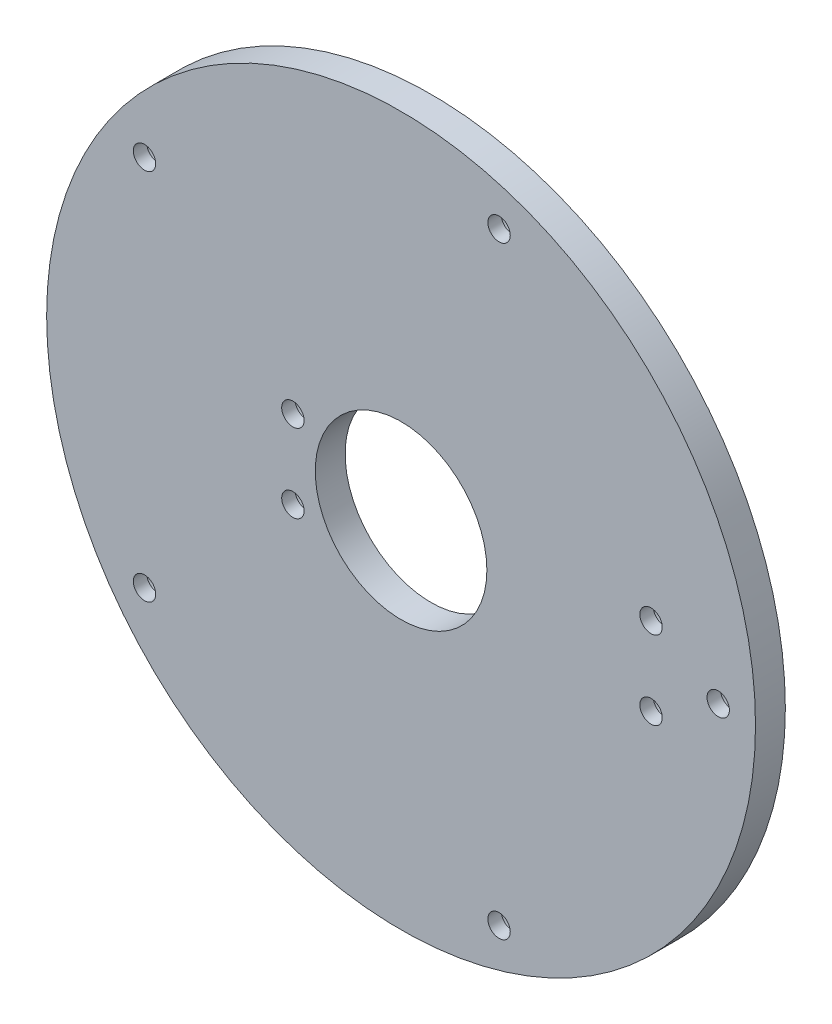
ISO-10303-21;
HEADER;
FILE_DESCRIPTION(('STEP AP214'),'2;1');
FILE_NAME('part.step','',(''),(''),'','','');
FILE_SCHEMA(('AUTOMOTIVE_DESIGN { 1 0 10303 214 1 1 1 1 }'));
ENDSEC;
DATA;
#1=APPLICATION_CONTEXT('core data for automotive mechanical design processes');
#2=APPLICATION_PROTOCOL_DEFINITION('international standard','automotive_design',2000,#1);
#3=PRODUCT_CONTEXT('',#1,'mechanical');
#4=PRODUCT('Part','Part','',(#3));
#5=PRODUCT_RELATED_PRODUCT_CATEGORY('part','',(#4));
#6=PRODUCT_DEFINITION_FORMATION('','',#4);
#7=PRODUCT_DEFINITION_CONTEXT('part definition',#1,'design');
#8=PRODUCT_DEFINITION('design','',#6,#7);
#9=PRODUCT_DEFINITION_SHAPE('','',#8);
#10=(LENGTH_UNIT() NAMED_UNIT(*) SI_UNIT(.MILLI.,.METRE.));
#11=(NAMED_UNIT(*) PLANE_ANGLE_UNIT() SI_UNIT($,.RADIAN.));
#12=(NAMED_UNIT(*) SI_UNIT($,.STERADIAN.) SOLID_ANGLE_UNIT());
#13=UNCERTAINTY_MEASURE_WITH_UNIT(LENGTH_MEASURE(1.E-05),#10,'distance_accuracy_value','');
#14=(GEOMETRIC_REPRESENTATION_CONTEXT(3) GLOBAL_UNCERTAINTY_ASSIGNED_CONTEXT((#13)) GLOBAL_UNIT_ASSIGNED_CONTEXT((#10,
#11,#12)) REPRESENTATION_CONTEXT('',''));
#15=CARTESIAN_POINT('',(0.,0.,0.));
#16=DIRECTION('',(0.,0.,1.));
#17=DIRECTION('',(1.,0.,0.));
#18=AXIS2_PLACEMENT_3D('',#15,#16,#17);
#19=CARTESIAN_POINT('',(47.5,-57.1414213562373,0.));
#20=DIRECTION('',(0.,0.,1.));
#21=DIRECTION('',(1.,0.,0.));
#22=AXIS2_PLACEMENT_3D('',#19,#20,#21);
#23=PLANE('',#22);
#24=CARTESIAN_POINT('',(81.0000000000001,42.125,0.));
#25=DIRECTION('',(0.,0.,1.));
#26=DIRECTION('',(1.,0.,0.));
#27=AXIS2_PLACEMENT_3D('',#24,#25,#26);
#28=CIRCLE('',#27,2.75);
#29=CARTESIAN_POINT('',(83.7500000000001,42.125,0.));
#30=VERTEX_POINT('',#29);
#31=EDGE_CURVE('E182',#30,#30,#28,.T.);
#32=ORIENTED_EDGE('',*,*,#31,.T.);
#33=EDGE_LOOP('',(#32));
#34=FACE_BOUND('',#33,.T.);
#35=CARTESIAN_POINT('',(81.0000000000001,52.625,0.));
#36=DIRECTION('',(0.,0.,1.));
#37=DIRECTION('',(1.,0.,0.));
#38=AXIS2_PLACEMENT_3D('',#35,#36,#37);
#39=CIRCLE('',#38,2.75);
#40=CARTESIAN_POINT('',(83.7500000000001,52.625,0.));
#41=VERTEX_POINT('',#40);
#42=EDGE_CURVE('E193',#41,#41,#39,.T.);
#43=ORIENTED_EDGE('',*,*,#42,.T.);
#44=EDGE_LOOP('',(#43));
#45=FACE_BOUND('',#44,.T.);
#46=CARTESIAN_POINT('',(13.1167777390647,72.4808732224301,0.));
#47=DIRECTION('',(0.,0.,1.));
#48=DIRECTION('',(1.,0.,0.));
#49=AXIS2_PLACEMENT_3D('',#46,#47,#48);
#50=CIRCLE('',#49,2.75);
#51=CARTESIAN_POINT('',(15.8667777390647,72.4808732224301,0.));
#52=VERTEX_POINT('',#51);
#53=EDGE_CURVE('E209',#52,#52,#50,.T.);
#54=ORIENTED_EDGE('',*,*,#53,.T.);
#55=EDGE_LOOP('',(#54));
#56=FACE_BOUND('',#55,.T.);
#57=CARTESIAN_POINT('',(33.,42.125,0.));
#58=DIRECTION('',(0.,0.,1.));
#59=DIRECTION('',(1.,0.,0.));
#60=AXIS2_PLACEMENT_3D('',#57,#58,#59);
#61=CIRCLE('',#60,2.75);
#62=CARTESIAN_POINT('',(35.75,42.125,0.));
#63=VERTEX_POINT('',#62);
#64=EDGE_CURVE('E225',#63,#63,#61,.T.);
#65=ORIENTED_EDGE('',*,*,#64,.T.);
#66=EDGE_LOOP('',(#65));
#67=FACE_BOUND('',#66,.T.);
#68=CARTESIAN_POINT('',(47.5,47.5,0.));
#69=DIRECTION('',(0.,0.,1.));
#70=DIRECTION('',(1.,0.,0.));
#71=AXIS2_PLACEMENT_3D('',#68,#69,#70);
#72=CIRCLE('',#71,47.5);
#73=CARTESIAN_POINT('',(95.,47.5,0.));
#74=VERTEX_POINT('',#73);
#75=EDGE_CURVE('E34',#74,#74,#72,.T.);
#76=ORIENTED_EDGE('',*,*,#75,.F.);
#77=EDGE_LOOP('',(#76));
#78=FACE_BOUND('',#77,.T.);
#79=CARTESIAN_POINT('',(47.5,47.5,0.));
#80=DIRECTION('',(0.,0.,1.));
#81=DIRECTION('',(1.,0.,0.));
#82=AXIS2_PLACEMENT_3D('',#79,#80,#81);
#83=CIRCLE('',#82,11.5);
#84=CARTESIAN_POINT('',(59.,47.5,0.));
#85=VERTEX_POINT('',#84);
#86=EDGE_CURVE('E46',#85,#85,#83,.T.);
#87=ORIENTED_EDGE('',*,*,#86,.T.);
#88=EDGE_LOOP('',(#87));
#89=FACE_BOUND('',#88,.T.);
#90=CARTESIAN_POINT('',(33.,52.625,0.));
#91=DIRECTION('',(0.,0.,1.));
#92=DIRECTION('',(1.,0.,0.));
#93=AXIS2_PLACEMENT_3D('',#90,#91,#92);
#94=CIRCLE('',#93,2.75);
#95=CARTESIAN_POINT('',(35.75,52.625,0.));
#96=VERTEX_POINT('',#95);
#97=EDGE_CURVE('E59',#96,#96,#94,.T.);
#98=ORIENTED_EDGE('',*,*,#97,.T.);
#99=EDGE_LOOP('',(#98));
#100=FACE_BOUND('',#99,.T.);
#101=CARTESIAN_POINT('',(13.1167777390647,22.5191267775699,0.));
#102=DIRECTION('',(0.,0.,1.));
#103=DIRECTION('',(1.,0.,0.));
#104=AXIS2_PLACEMENT_3D('',#101,#102,#103);
#105=CIRCLE('',#104,2.75);
#106=CARTESIAN_POINT('',(15.8667777390647,22.5191267775699,0.));
#107=VERTEX_POINT('',#106);
#108=EDGE_CURVE('E158',#107,#107,#105,.T.);
#109=ORIENTED_EDGE('',*,*,#108,.T.);
#110=EDGE_LOOP('',(#109));
#111=FACE_BOUND('',#110,.T.);
#112=CARTESIAN_POINT('',(60.6332222609353,87.919901942544,0.));
#113=DIRECTION('',(0.,0.,1.));
#114=DIRECTION('',(1.,0.,0.));
#115=AXIS2_PLACEMENT_3D('',#112,#113,#114);
#116=CIRCLE('',#115,2.75);
#117=CARTESIAN_POINT('',(63.3832222609353,87.919901942544,0.));
#118=VERTEX_POINT('',#117);
#119=EDGE_CURVE('E162',#118,#118,#116,.T.);
#120=ORIENTED_EDGE('',*,*,#119,.T.);
#121=EDGE_LOOP('',(#120));
#122=FACE_BOUND('',#121,.T.);
#123=CARTESIAN_POINT('',(90.,47.5,0.));
#124=DIRECTION('',(0.,0.,1.));
#125=DIRECTION('',(1.,0.,0.));
#126=AXIS2_PLACEMENT_3D('',#123,#124,#125);
#127=CIRCLE('',#126,2.75);
#128=CARTESIAN_POINT('',(92.75,47.5,0.));
#129=VERTEX_POINT('',#128);
#130=EDGE_CURVE('E166',#129,#129,#127,.T.);
#131=ORIENTED_EDGE('',*,*,#130,.T.);
#132=EDGE_LOOP('',(#131));
#133=FACE_BOUND('',#132,.T.);
#134=CARTESIAN_POINT('',(60.6332222609353,7.08009805745598,0.));
#135=DIRECTION('',(0.,0.,1.));
#136=DIRECTION('',(1.,0.,0.));
#137=AXIS2_PLACEMENT_3D('',#134,#135,#136);
#138=CIRCLE('',#137,2.75);
#139=CARTESIAN_POINT('',(63.3832222609353,7.08009805745598,0.));
#140=VERTEX_POINT('',#139);
#141=EDGE_CURVE('E169',#140,#140,#138,.T.);
#142=ORIENTED_EDGE('',*,*,#141,.T.);
#143=EDGE_LOOP('',(#142));
#144=FACE_BOUND('',#143,.T.);
#145=ADVANCED_FACE('F30',(#34,#45,#56,#67,#78,#89,#100,#111,#122,#133,#144),#23,.F.);
#146=CARTESIAN_POINT('',(90.,47.5,4.));
#147=DIRECTION('',(0.,0.,-1.));
#148=DIRECTION('',(-1.,0.,0.));
#149=AXIS2_PLACEMENT_3D('',#146,#147,#148);
#150=CYLINDRICAL_SURFACE('',#149,1.5);
#151=CARTESIAN_POINT('',(90.,47.5,2.2));
#152=DIRECTION('',(0.,0.,1.));
#153=DIRECTION('',(1.,0.,0.));
#154=AXIS2_PLACEMENT_3D('',#151,#152,#153);
#155=CIRCLE('',#154,1.5);
#156=CARTESIAN_POINT('',(91.5,47.5,2.2));
#157=VERTEX_POINT('',#156);
#158=EDGE_CURVE('E187',#157,#157,#155,.T.);
#159=ORIENTED_EDGE('',*,*,#158,.F.);
#160=EDGE_LOOP('',(#159));
#161=FACE_BOUND('',#160,.T.);
#162=CARTESIAN_POINT('',(90.,47.5,4.));
#163=DIRECTION('',(0.,0.,1.));
#164=DIRECTION('',(1.,0.,0.));
#165=AXIS2_PLACEMENT_3D('',#162,#163,#164);
#166=CIRCLE('',#165,1.5);
#167=CARTESIAN_POINT('',(91.5,47.5,4.));
#168=VERTEX_POINT('',#167);
#169=EDGE_CURVE('E38',#168,#168,#166,.T.);
#170=ORIENTED_EDGE('',*,*,#169,.T.);
#171=EDGE_LOOP('',(#170));
#172=FACE_BOUND('',#171,.T.);
#173=ADVANCED_FACE('F103',(#161,#172),#150,.F.);
#174=CARTESIAN_POINT('',(81.0000000000001,52.625,4.));
#175=DIRECTION('',(0.,0.,-1.));
#176=DIRECTION('',(-1.,0.,0.));
#177=AXIS2_PLACEMENT_3D('',#174,#175,#176);
#178=CYLINDRICAL_SURFACE('',#177,1.5);
#179=CARTESIAN_POINT('',(81.0000000000001,52.625,2.2));
#180=DIRECTION('',(0.,0.,1.));
#181=DIRECTION('',(1.,0.,0.));
#182=AXIS2_PLACEMENT_3D('',#179,#180,#181);
#183=CIRCLE('',#182,1.5);
#184=CARTESIAN_POINT('',(82.5000000000001,52.625,2.2));
#185=VERTEX_POINT('',#184);
#186=EDGE_CURVE('E195',#185,#185,#183,.T.);
#187=ORIENTED_EDGE('',*,*,#186,.F.);
#188=EDGE_LOOP('',(#187));
#189=FACE_BOUND('',#188,.T.);
#190=CARTESIAN_POINT('',(81.0000000000001,52.625,4.));
#191=DIRECTION('',(0.,0.,1.));
#192=DIRECTION('',(1.,0.,0.));
#193=AXIS2_PLACEMENT_3D('',#190,#191,#192);
#194=CIRCLE('',#193,1.5);
#195=CARTESIAN_POINT('',(82.5000000000001,52.625,4.));
#196=VERTEX_POINT('',#195);
#197=EDGE_CURVE('E43',#196,#196,#194,.T.);
#198=ORIENTED_EDGE('',*,*,#197,.T.);
#199=EDGE_LOOP('',(#198));
#200=FACE_BOUND('',#199,.T.);
#201=ADVANCED_FACE('F91',(#189,#200),#178,.F.);
#202=CARTESIAN_POINT('',(60.6332222609353,87.919901942544,4.));
#203=DIRECTION('',(0.,0.,-1.));
#204=DIRECTION('',(-1.,0.,0.));
#205=AXIS2_PLACEMENT_3D('',#202,#203,#204);
#206=CYLINDRICAL_SURFACE('',#205,1.5);
#207=CARTESIAN_POINT('',(60.6332222609353,87.919901942544,2.2));
#208=DIRECTION('',(0.,0.,1.));
#209=DIRECTION('',(1.,0.,0.));
#210=AXIS2_PLACEMENT_3D('',#207,#208,#209);
#211=CIRCLE('',#210,1.5);
#212=CARTESIAN_POINT('',(62.1332222609353,87.919901942544,2.2));
#213=VERTEX_POINT('',#212);
#214=EDGE_CURVE('E203',#213,#213,#211,.T.);
#215=ORIENTED_EDGE('',*,*,#214,.F.);
#216=EDGE_LOOP('',(#215));
#217=FACE_BOUND('',#216,.T.);
#218=CARTESIAN_POINT('',(60.6332222609353,87.919901942544,4.));
#219=DIRECTION('',(0.,0.,1.));
#220=DIRECTION('',(1.,0.,0.));
#221=AXIS2_PLACEMENT_3D('',#218,#219,#220);
#222=CIRCLE('',#221,1.5);
#223=CARTESIAN_POINT('',(62.1332222609353,87.919901942544,4.));
#224=VERTEX_POINT('',#223);
#225=EDGE_CURVE('E86',#224,#224,#222,.T.);
#226=ORIENTED_EDGE('',*,*,#225,.T.);
#227=EDGE_LOOP('',(#226));
#228=FACE_BOUND('',#227,.T.);
#229=ADVANCED_FACE('F111',(#217,#228),#206,.F.);
#230=CARTESIAN_POINT('',(13.1167777390647,72.4808732224301,4.));
#231=DIRECTION('',(0.,0.,-1.));
#232=DIRECTION('',(-1.,0.,0.));
#233=AXIS2_PLACEMENT_3D('',#230,#231,#232);
#234=CYLINDRICAL_SURFACE('',#233,1.5);
#235=CARTESIAN_POINT('',(13.1167777390647,72.4808732224301,2.2));
#236=DIRECTION('',(0.,0.,1.));
#237=DIRECTION('',(1.,0.,0.));
#238=AXIS2_PLACEMENT_3D('',#235,#236,#237);
#239=CIRCLE('',#238,1.5);
#240=CARTESIAN_POINT('',(14.6167777390647,72.4808732224301,2.2));
#241=VERTEX_POINT('',#240);
#242=EDGE_CURVE('E211',#241,#241,#239,.T.);
#243=ORIENTED_EDGE('',*,*,#242,.F.);
#244=EDGE_LOOP('',(#243));
#245=FACE_BOUND('',#244,.T.);
#246=CARTESIAN_POINT('',(13.1167777390647,72.4808732224301,4.));
#247=DIRECTION('',(0.,0.,1.));
#248=DIRECTION('',(1.,0.,0.));
#249=AXIS2_PLACEMENT_3D('',#246,#247,#248);
#250=CIRCLE('',#249,1.5);
#251=CARTESIAN_POINT('',(14.6167777390647,72.4808732224301,4.));
#252=VERTEX_POINT('',#251);
#253=EDGE_CURVE('E83',#252,#252,#250,.T.);
#254=ORIENTED_EDGE('',*,*,#253,.T.);
#255=EDGE_LOOP('',(#254));
#256=FACE_BOUND('',#255,.T.);
#257=ADVANCED_FACE('F121',(#245,#256),#234,.F.);
#258=CARTESIAN_POINT('',(33.,52.625,4.));
#259=DIRECTION('',(0.,0.,-1.));
#260=DIRECTION('',(-1.,0.,0.));
#261=AXIS2_PLACEMENT_3D('',#258,#259,#260);
#262=CYLINDRICAL_SURFACE('',#261,1.5);
#263=CARTESIAN_POINT('',(33.,52.625,2.2));
#264=DIRECTION('',(0.,0.,1.));
#265=DIRECTION('',(1.,0.,0.));
#266=AXIS2_PLACEMENT_3D('',#263,#264,#265);
#267=CIRCLE('',#266,1.5);
#268=CARTESIAN_POINT('',(34.5,52.625,2.2));
#269=VERTEX_POINT('',#268);
#270=EDGE_CURVE('E54',#269,#269,#267,.T.);
#271=ORIENTED_EDGE('',*,*,#270,.F.);
#272=EDGE_LOOP('',(#271));
#273=FACE_BOUND('',#272,.T.);
#274=CARTESIAN_POINT('',(33.,52.625,4.));
#275=DIRECTION('',(0.,0.,1.));
#276=DIRECTION('',(1.,0.,0.));
#277=AXIS2_PLACEMENT_3D('',#274,#275,#276);
#278=CIRCLE('',#277,1.5);
#279=CARTESIAN_POINT('',(34.5,52.625,4.));
#280=VERTEX_POINT('',#279);
#281=EDGE_CURVE('E80',#280,#280,#278,.T.);
#282=ORIENTED_EDGE('',*,*,#281,.T.);
#283=EDGE_LOOP('',(#282));
#284=FACE_BOUND('',#283,.T.);
#285=ADVANCED_FACE('F125',(#273,#284),#262,.F.);
#286=CARTESIAN_POINT('',(33.,42.125,4.));
#287=DIRECTION('',(0.,0.,-1.));
#288=DIRECTION('',(-1.,0.,0.));
#289=AXIS2_PLACEMENT_3D('',#286,#287,#288);
#290=CYLINDRICAL_SURFACE('',#289,1.5);
#291=CARTESIAN_POINT('',(33.,42.125,2.2));
#292=DIRECTION('',(0.,0.,1.));
#293=DIRECTION('',(1.,0.,0.));
#294=AXIS2_PLACEMENT_3D('',#291,#292,#293);
#295=CIRCLE('',#294,1.5);
#296=CARTESIAN_POINT('',(34.5,42.125,2.2));
#297=VERTEX_POINT('',#296);
#298=EDGE_CURVE('E227',#297,#297,#295,.T.);
#299=ORIENTED_EDGE('',*,*,#298,.F.);
#300=EDGE_LOOP('',(#299));
#301=FACE_BOUND('',#300,.T.);
#302=CARTESIAN_POINT('',(33.,42.125,4.));
#303=DIRECTION('',(0.,0.,1.));
#304=DIRECTION('',(1.,0.,0.));
#305=AXIS2_PLACEMENT_3D('',#302,#303,#304);
#306=CIRCLE('',#305,1.5);
#307=CARTESIAN_POINT('',(34.5,42.125,4.));
#308=VERTEX_POINT('',#307);
#309=EDGE_CURVE('E77',#308,#308,#306,.T.);
#310=ORIENTED_EDGE('',*,*,#309,.T.);
#311=EDGE_LOOP('',(#310));
#312=FACE_BOUND('',#311,.T.);
#313=ADVANCED_FACE('F129',(#301,#312),#290,.F.);
#314=CARTESIAN_POINT('',(60.6332222609353,7.08009805745598,4.));
#315=DIRECTION('',(0.,0.,-1.));
#316=DIRECTION('',(-1.,0.,0.));
#317=AXIS2_PLACEMENT_3D('',#314,#315,#316);
#318=CYLINDRICAL_SURFACE('',#317,1.5);
#319=CARTESIAN_POINT('',(60.6332222609353,7.08009805745598,2.2));
#320=DIRECTION('',(0.,0.,1.));
#321=DIRECTION('',(1.,0.,0.));
#322=AXIS2_PLACEMENT_3D('',#319,#320,#321);
#323=CIRCLE('',#322,1.5);
#324=CARTESIAN_POINT('',(62.1332222609353,7.08009805745598,2.2));
#325=VERTEX_POINT('',#324);
#326=EDGE_CURVE('E171',#325,#325,#323,.T.);
#327=ORIENTED_EDGE('',*,*,#326,.F.);
#328=EDGE_LOOP('',(#327));
#329=FACE_BOUND('',#328,.T.);
#330=CARTESIAN_POINT('',(60.6332222609353,7.08009805745598,4.));
#331=DIRECTION('',(0.,0.,1.));
#332=DIRECTION('',(1.,0.,0.));
#333=AXIS2_PLACEMENT_3D('',#330,#331,#332);
#334=CIRCLE('',#333,1.5);
#335=CARTESIAN_POINT('',(62.1332222609353,7.08009805745598,4.));
#336=VERTEX_POINT('',#335);
#337=EDGE_CURVE('E74',#336,#336,#334,.T.);
#338=ORIENTED_EDGE('',*,*,#337,.T.);
#339=EDGE_LOOP('',(#338));
#340=FACE_BOUND('',#339,.T.);
#341=ADVANCED_FACE('F133',(#329,#340),#318,.F.);
#342=CARTESIAN_POINT('',(13.1167777390647,22.5191267775699,4.));
#343=DIRECTION('',(0.,0.,-1.));
#344=DIRECTION('',(-1.,0.,0.));
#345=AXIS2_PLACEMENT_3D('',#342,#343,#344);
#346=CYLINDRICAL_SURFACE('',#345,1.5);
#347=CARTESIAN_POINT('',(13.1167777390647,22.5191267775699,2.2));
#348=DIRECTION('',(0.,0.,1.));
#349=DIRECTION('',(1.,0.,0.));
#350=AXIS2_PLACEMENT_3D('',#347,#348,#349);
#351=CIRCLE('',#350,1.5);
#352=CARTESIAN_POINT('',(14.6167777390647,22.5191267775699,2.2));
#353=VERTEX_POINT('',#352);
#354=EDGE_CURVE('E219',#353,#353,#351,.T.);
#355=ORIENTED_EDGE('',*,*,#354,.F.);
#356=EDGE_LOOP('',(#355));
#357=FACE_BOUND('',#356,.T.);
#358=CARTESIAN_POINT('',(13.1167777390647,22.5191267775699,4.));
#359=DIRECTION('',(0.,0.,1.));
#360=DIRECTION('',(1.,0.,0.));
#361=AXIS2_PLACEMENT_3D('',#358,#359,#360);
#362=CIRCLE('',#361,1.5);
#363=CARTESIAN_POINT('',(14.6167777390647,22.5191267775699,4.));
#364=VERTEX_POINT('',#363);
#365=EDGE_CURVE('E71',#364,#364,#362,.T.);
#366=ORIENTED_EDGE('',*,*,#365,.T.);
#367=EDGE_LOOP('',(#366));
#368=FACE_BOUND('',#367,.T.);
#369=ADVANCED_FACE('F137',(#357,#368),#346,.F.);
#370=CARTESIAN_POINT('',(47.5,47.5,4.));
#371=DIRECTION('',(0.,0.,-1.));
#372=DIRECTION('',(-1.,0.,0.));
#373=AXIS2_PLACEMENT_3D('',#370,#371,#372);
#374=CYLINDRICAL_SURFACE('',#373,47.5);
#375=CARTESIAN_POINT('',(47.5,47.5,4.));
#376=DIRECTION('',(0.,0.,1.));
#377=DIRECTION('',(1.,0.,0.));
#378=AXIS2_PLACEMENT_3D('',#375,#376,#377);
#379=CIRCLE('',#378,47.5);
#380=CARTESIAN_POINT('',(95.,47.5,4.));
#381=VERTEX_POINT('',#380);
#382=EDGE_CURVE('E68',#381,#381,#379,.T.);
#383=ORIENTED_EDGE('',*,*,#382,.F.);
#384=EDGE_LOOP('',(#383));
#385=FACE_BOUND('',#384,.T.);
#386=ORIENTED_EDGE('',*,*,#75,.T.);
#387=EDGE_LOOP('',(#386));
#388=FACE_BOUND('',#387,.T.);
#389=ADVANCED_FACE('F140',(#385,#388),#374,.T.);
#390=CARTESIAN_POINT('',(47.5,47.5,4.));
#391=DIRECTION('',(0.,0.,-1.));
#392=DIRECTION('',(-1.,0.,0.));
#393=AXIS2_PLACEMENT_3D('',#390,#391,#392);
#394=CYLINDRICAL_SURFACE('',#393,11.5);
#395=CARTESIAN_POINT('',(47.5,47.5,4.));
#396=DIRECTION('',(0.,0.,1.));
#397=DIRECTION('',(1.,0.,0.));
#398=AXIS2_PLACEMENT_3D('',#395,#396,#397);
#399=CIRCLE('',#398,11.5);
#400=CARTESIAN_POINT('',(59.,47.5,4.));
#401=VERTEX_POINT('',#400);
#402=EDGE_CURVE('E52',#401,#401,#399,.T.);
#403=ORIENTED_EDGE('',*,*,#402,.T.);
#404=EDGE_LOOP('',(#403));
#405=FACE_BOUND('',#404,.T.);
#406=ORIENTED_EDGE('',*,*,#86,.F.);
#407=EDGE_LOOP('',(#406));
#408=FACE_BOUND('',#407,.T.);
#409=ADVANCED_FACE('F32',(#405,#408),#394,.F.);
#410=CARTESIAN_POINT('',(81.0000000000001,42.125,4.));
#411=DIRECTION('',(0.,0.,-1.));
#412=DIRECTION('',(-1.,0.,0.));
#413=AXIS2_PLACEMENT_3D('',#410,#411,#412);
#414=CYLINDRICAL_SURFACE('',#413,1.5);
#415=CARTESIAN_POINT('',(81.0000000000001,42.125,2.2));
#416=DIRECTION('',(0.,0.,1.));
#417=DIRECTION('',(1.,0.,0.));
#418=AXIS2_PLACEMENT_3D('',#415,#416,#417);
#419=CIRCLE('',#418,1.5);
#420=CARTESIAN_POINT('',(82.5000000000001,42.125,2.2));
#421=VERTEX_POINT('',#420);
#422=EDGE_CURVE('E178',#421,#421,#419,.T.);
#423=ORIENTED_EDGE('',*,*,#422,.F.);
#424=EDGE_LOOP('',(#423));
#425=FACE_BOUND('',#424,.T.);
#426=CARTESIAN_POINT('',(81.0000000000001,42.125,4.));
#427=DIRECTION('',(0.,0.,1.));
#428=DIRECTION('',(1.,0.,0.));
#429=AXIS2_PLACEMENT_3D('',#426,#427,#428);
#430=CIRCLE('',#429,1.5);
#431=CARTESIAN_POINT('',(82.5000000000001,42.125,4.));
#432=VERTEX_POINT('',#431);
#433=EDGE_CURVE('E10',#432,#432,#430,.T.);
#434=ORIENTED_EDGE('',*,*,#433,.T.);
#435=EDGE_LOOP('',(#434));
#436=FACE_BOUND('',#435,.T.);
#437=ADVANCED_FACE('F97',(#425,#436),#414,.F.);
#438=CARTESIAN_POINT('',(47.5,-57.1414213562373,4.));
#439=DIRECTION('',(0.,0.,1.));
#440=DIRECTION('',(1.,0.,0.));
#441=AXIS2_PLACEMENT_3D('',#438,#439,#440);
#442=PLANE('',#441);
#443=ORIENTED_EDGE('',*,*,#402,.F.);
#444=EDGE_LOOP('',(#443));
#445=FACE_BOUND('',#444,.T.);
#446=ORIENTED_EDGE('',*,*,#382,.T.);
#447=EDGE_LOOP('',(#446));
#448=FACE_BOUND('',#447,.T.);
#449=ORIENTED_EDGE('',*,*,#365,.F.);
#450=EDGE_LOOP('',(#449));
#451=FACE_BOUND('',#450,.T.);
#452=ORIENTED_EDGE('',*,*,#337,.F.);
#453=EDGE_LOOP('',(#452));
#454=FACE_BOUND('',#453,.T.);
#455=ORIENTED_EDGE('',*,*,#309,.F.);
#456=EDGE_LOOP('',(#455));
#457=FACE_BOUND('',#456,.T.);
#458=ORIENTED_EDGE('',*,*,#281,.F.);
#459=EDGE_LOOP('',(#458));
#460=FACE_BOUND('',#459,.T.);
#461=ORIENTED_EDGE('',*,*,#253,.F.);
#462=EDGE_LOOP('',(#461));
#463=FACE_BOUND('',#462,.T.);
#464=ORIENTED_EDGE('',*,*,#225,.F.);
#465=EDGE_LOOP('',(#464));
#466=FACE_BOUND('',#465,.T.);
#467=ORIENTED_EDGE('',*,*,#197,.F.);
#468=EDGE_LOOP('',(#467));
#469=FACE_BOUND('',#468,.T.);
#470=ORIENTED_EDGE('',*,*,#169,.F.);
#471=EDGE_LOOP('',(#470));
#472=FACE_BOUND('',#471,.T.);
#473=ORIENTED_EDGE('',*,*,#433,.F.);
#474=EDGE_LOOP('',(#473));
#475=FACE_BOUND('',#474,.T.);
#476=ADVANCED_FACE('F93',(#445,#448,#451,#454,#457,#460,#463,#466,#469,#472,#475),#442,.T.);
#477=CARTESIAN_POINT('',(33.,52.625,2.2));
#478=DIRECTION('',(0.,0.,-1.));
#479=DIRECTION('',(-1.,0.,0.));
#480=AXIS2_PLACEMENT_3D('',#477,#478,#479);
#481=CYLINDRICAL_SURFACE('',#480,2.75);
#482=CARTESIAN_POINT('',(33.,52.625,2.2));
#483=DIRECTION('',(0.,0.,1.));
#484=DIRECTION('',(1.,0.,0.));
#485=AXIS2_PLACEMENT_3D('',#482,#483,#484);
#486=CIRCLE('',#485,2.75);
#487=CARTESIAN_POINT('',(35.75,52.625,2.2));
#488=VERTEX_POINT('',#487);
#489=EDGE_CURVE('E48',#488,#488,#486,.T.);
#490=ORIENTED_EDGE('',*,*,#489,.T.);
#491=EDGE_LOOP('',(#490));
#492=FACE_BOUND('',#491,.T.);
#493=ORIENTED_EDGE('',*,*,#97,.F.);
#494=EDGE_LOOP('',(#493));
#495=FACE_BOUND('',#494,.T.);
#496=ADVANCED_FACE('F96',(#492,#495),#481,.F.);
#497=CARTESIAN_POINT('',(47.5,-57.1414213562373,2.2));
#498=DIRECTION('',(0.,0.,1.));
#499=DIRECTION('',(1.,0.,0.));
#500=AXIS2_PLACEMENT_3D('',#497,#498,#499);
#501=PLANE('',#500);
#502=ORIENTED_EDGE('',*,*,#270,.T.);
#503=EDGE_LOOP('',(#502));
#504=FACE_BOUND('',#503,.T.);
#505=ORIENTED_EDGE('',*,*,#489,.F.);
#506=EDGE_LOOP('',(#505));
#507=FACE_BOUND('',#506,.T.);
#508=ADVANCED_FACE('F238',(#504,#507),#501,.F.);
#509=CARTESIAN_POINT('',(33.,42.125,2.2));
#510=DIRECTION('',(0.,0.,-1.));
#511=DIRECTION('',(-1.,0.,0.));
#512=AXIS2_PLACEMENT_3D('',#509,#510,#511);
#513=CYLINDRICAL_SURFACE('',#512,2.75);
#514=CARTESIAN_POINT('',(33.,42.125,2.2));
#515=DIRECTION('',(0.,0.,1.));
#516=DIRECTION('',(1.,0.,0.));
#517=AXIS2_PLACEMENT_3D('',#514,#515,#516);
#518=CIRCLE('',#517,2.75);
#519=CARTESIAN_POINT('',(35.75,42.125,2.2));
#520=VERTEX_POINT('',#519);
#521=EDGE_CURVE('E65',#520,#520,#518,.T.);
#522=ORIENTED_EDGE('',*,*,#521,.T.);
#523=EDGE_LOOP('',(#522));
#524=FACE_BOUND('',#523,.T.);
#525=ORIENTED_EDGE('',*,*,#64,.F.);
#526=EDGE_LOOP('',(#525));
#527=FACE_BOUND('',#526,.T.);
#528=ADVANCED_FACE('F235',(#524,#527),#513,.F.);
#529=CARTESIAN_POINT('',(47.5,-57.1414213562373,2.2));
#530=DIRECTION('',(0.,0.,1.));
#531=DIRECTION('',(1.,0.,0.));
#532=AXIS2_PLACEMENT_3D('',#529,#530,#531);
#533=PLANE('',#532);
#534=ORIENTED_EDGE('',*,*,#298,.T.);
#535=EDGE_LOOP('',(#534));
#536=FACE_BOUND('',#535,.T.);
#537=ORIENTED_EDGE('',*,*,#521,.F.);
#538=EDGE_LOOP('',(#537));
#539=FACE_BOUND('',#538,.T.);
#540=ADVANCED_FACE('F237',(#536,#539),#533,.F.);
#541=CARTESIAN_POINT('',(13.1167777390647,22.5191267775699,2.2));
#542=DIRECTION('',(0.,0.,-1.));
#543=DIRECTION('',(-1.,0.,0.));
#544=AXIS2_PLACEMENT_3D('',#541,#542,#543);
#545=CYLINDRICAL_SURFACE('',#544,2.75);
#546=CARTESIAN_POINT('',(13.1167777390647,22.5191267775699,2.2));
#547=DIRECTION('',(0.,0.,1.));
#548=DIRECTION('',(1.,0.,0.));
#549=AXIS2_PLACEMENT_3D('',#546,#547,#548);
#550=CIRCLE('',#549,2.75);
#551=CARTESIAN_POINT('',(15.8667777390647,22.5191267775699,2.2));
#552=VERTEX_POINT('',#551);
#553=EDGE_CURVE('E222',#552,#552,#550,.T.);
#554=ORIENTED_EDGE('',*,*,#553,.T.);
#555=EDGE_LOOP('',(#554));
#556=FACE_BOUND('',#555,.T.);
#557=ORIENTED_EDGE('',*,*,#108,.F.);
#558=EDGE_LOOP('',(#557));
#559=FACE_BOUND('',#558,.T.);
#560=ADVANCED_FACE('F245',(#556,#559),#545,.F.);
#561=CARTESIAN_POINT('',(47.5,-57.1414213562373,2.2));
#562=DIRECTION('',(0.,0.,1.));
#563=DIRECTION('',(1.,0.,0.));
#564=AXIS2_PLACEMENT_3D('',#561,#562,#563);
#565=PLANE('',#564);
#566=ORIENTED_EDGE('',*,*,#354,.T.);
#567=EDGE_LOOP('',(#566));
#568=FACE_BOUND('',#567,.T.);
#569=ORIENTED_EDGE('',*,*,#553,.F.);
#570=EDGE_LOOP('',(#569));
#571=FACE_BOUND('',#570,.T.);
#572=ADVANCED_FACE('F283',(#568,#571),#565,.F.);
#573=CARTESIAN_POINT('',(13.1167777390647,72.4808732224301,2.2));
#574=DIRECTION('',(0.,0.,-1.));
#575=DIRECTION('',(-1.,0.,0.));
#576=AXIS2_PLACEMENT_3D('',#573,#574,#575);
#577=CYLINDRICAL_SURFACE('',#576,2.75);
#578=CARTESIAN_POINT('',(13.1167777390647,72.4808732224301,2.2));
#579=DIRECTION('',(0.,0.,1.));
#580=DIRECTION('',(1.,0.,0.));
#581=AXIS2_PLACEMENT_3D('',#578,#579,#580);
#582=CIRCLE('',#581,2.75);
#583=CARTESIAN_POINT('',(15.8667777390647,72.4808732224301,2.2));
#584=VERTEX_POINT('',#583);
#585=EDGE_CURVE('E214',#584,#584,#582,.T.);
#586=ORIENTED_EDGE('',*,*,#585,.T.);
#587=EDGE_LOOP('',(#586));
#588=FACE_BOUND('',#587,.T.);
#589=ORIENTED_EDGE('',*,*,#53,.F.);
#590=EDGE_LOOP('',(#589));
#591=FACE_BOUND('',#590,.T.);
#592=ADVANCED_FACE('F292',(#588,#591),#577,.F.);
#593=CARTESIAN_POINT('',(47.5,-57.1414213562373,2.2));
#594=DIRECTION('',(0.,0.,1.));
#595=DIRECTION('',(1.,0.,0.));
#596=AXIS2_PLACEMENT_3D('',#593,#594,#595);
#597=PLANE('',#596);
#598=ORIENTED_EDGE('',*,*,#242,.T.);
#599=EDGE_LOOP('',(#598));
#600=FACE_BOUND('',#599,.T.);
#601=ORIENTED_EDGE('',*,*,#585,.F.);
#602=EDGE_LOOP('',(#601));
#603=FACE_BOUND('',#602,.T.);
#604=ADVANCED_FACE('F302',(#600,#603),#597,.F.);
#605=CARTESIAN_POINT('',(60.6332222609353,87.919901942544,2.2));
#606=DIRECTION('',(0.,0.,-1.));
#607=DIRECTION('',(-1.,0.,0.));
#608=AXIS2_PLACEMENT_3D('',#605,#606,#607);
#609=CYLINDRICAL_SURFACE('',#608,2.75);
#610=CARTESIAN_POINT('',(60.6332222609353,87.919901942544,2.2));
#611=DIRECTION('',(0.,0.,1.));
#612=DIRECTION('',(1.,0.,0.));
#613=AXIS2_PLACEMENT_3D('',#610,#611,#612);
#614=CIRCLE('',#613,2.75);
#615=CARTESIAN_POINT('',(63.3832222609353,87.919901942544,2.2));
#616=VERTEX_POINT('',#615);
#617=EDGE_CURVE('E206',#616,#616,#614,.T.);
#618=ORIENTED_EDGE('',*,*,#617,.T.);
#619=EDGE_LOOP('',(#618));
#620=FACE_BOUND('',#619,.T.);
#621=ORIENTED_EDGE('',*,*,#119,.F.);
#622=EDGE_LOOP('',(#621));
#623=FACE_BOUND('',#622,.T.);
#624=ADVANCED_FACE('F312',(#620,#623),#609,.F.);
#625=CARTESIAN_POINT('',(47.5,-57.1414213562373,2.2));
#626=DIRECTION('',(0.,0.,1.));
#627=DIRECTION('',(1.,0.,0.));
#628=AXIS2_PLACEMENT_3D('',#625,#626,#627);
#629=PLANE('',#628);
#630=ORIENTED_EDGE('',*,*,#214,.T.);
#631=EDGE_LOOP('',(#630));
#632=FACE_BOUND('',#631,.T.);
#633=ORIENTED_EDGE('',*,*,#617,.F.);
#634=EDGE_LOOP('',(#633));
#635=FACE_BOUND('',#634,.T.);
#636=ADVANCED_FACE('F322',(#632,#635),#629,.F.);
#637=CARTESIAN_POINT('',(81.0000000000001,52.625,2.2));
#638=DIRECTION('',(0.,0.,-1.));
#639=DIRECTION('',(-1.,0.,0.));
#640=AXIS2_PLACEMENT_3D('',#637,#638,#639);
#641=CYLINDRICAL_SURFACE('',#640,2.75);
#642=CARTESIAN_POINT('',(81.0000000000001,52.625,2.2));
#643=DIRECTION('',(0.,0.,1.));
#644=DIRECTION('',(1.,0.,0.));
#645=AXIS2_PLACEMENT_3D('',#642,#643,#644);
#646=CIRCLE('',#645,2.75);
#647=CARTESIAN_POINT('',(83.7500000000001,52.625,2.2));
#648=VERTEX_POINT('',#647);
#649=EDGE_CURVE('E198',#648,#648,#646,.T.);
#650=ORIENTED_EDGE('',*,*,#649,.T.);
#651=EDGE_LOOP('',(#650));
#652=FACE_BOUND('',#651,.T.);
#653=ORIENTED_EDGE('',*,*,#42,.F.);
#654=EDGE_LOOP('',(#653));
#655=FACE_BOUND('',#654,.T.);
#656=ADVANCED_FACE('F332',(#652,#655),#641,.F.);
#657=CARTESIAN_POINT('',(47.5,-57.1414213562373,2.2));
#658=DIRECTION('',(0.,0.,1.));
#659=DIRECTION('',(1.,0.,0.));
#660=AXIS2_PLACEMENT_3D('',#657,#658,#659);
#661=PLANE('',#660);
#662=ORIENTED_EDGE('',*,*,#186,.T.);
#663=EDGE_LOOP('',(#662));
#664=FACE_BOUND('',#663,.T.);
#665=ORIENTED_EDGE('',*,*,#649,.F.);
#666=EDGE_LOOP('',(#665));
#667=FACE_BOUND('',#666,.T.);
#668=ADVANCED_FACE('F342',(#664,#667),#661,.F.);
#669=CARTESIAN_POINT('',(90.,47.5,2.2));
#670=DIRECTION('',(0.,0.,-1.));
#671=DIRECTION('',(-1.,0.,0.));
#672=AXIS2_PLACEMENT_3D('',#669,#670,#671);
#673=CYLINDRICAL_SURFACE('',#672,2.75);
#674=CARTESIAN_POINT('',(90.,47.5,2.2));
#675=DIRECTION('',(0.,0.,1.));
#676=DIRECTION('',(1.,0.,0.));
#677=AXIS2_PLACEMENT_3D('',#674,#675,#676);
#678=CIRCLE('',#677,2.75);
#679=CARTESIAN_POINT('',(92.75,47.5,2.2));
#680=VERTEX_POINT('',#679);
#681=EDGE_CURVE('E190',#680,#680,#678,.T.);
#682=ORIENTED_EDGE('',*,*,#681,.T.);
#683=EDGE_LOOP('',(#682));
#684=FACE_BOUND('',#683,.T.);
#685=ORIENTED_EDGE('',*,*,#130,.F.);
#686=EDGE_LOOP('',(#685));
#687=FACE_BOUND('',#686,.T.);
#688=ADVANCED_FACE('F352',(#684,#687),#673,.F.);
#689=CARTESIAN_POINT('',(47.5,-57.1414213562373,2.2));
#690=DIRECTION('',(0.,0.,1.));
#691=DIRECTION('',(1.,0.,0.));
#692=AXIS2_PLACEMENT_3D('',#689,#690,#691);
#693=PLANE('',#692);
#694=ORIENTED_EDGE('',*,*,#158,.T.);
#695=EDGE_LOOP('',(#694));
#696=FACE_BOUND('',#695,.T.);
#697=ORIENTED_EDGE('',*,*,#681,.F.);
#698=EDGE_LOOP('',(#697));
#699=FACE_BOUND('',#698,.T.);
#700=ADVANCED_FACE('F362',(#696,#699),#693,.F.);
#701=CARTESIAN_POINT('',(81.0000000000001,42.125,2.2));
#702=DIRECTION('',(0.,0.,-1.));
#703=DIRECTION('',(-1.,0.,0.));
#704=AXIS2_PLACEMENT_3D('',#701,#702,#703);
#705=CYLINDRICAL_SURFACE('',#704,2.75);
#706=CARTESIAN_POINT('',(81.0000000000001,42.125,2.2));
#707=DIRECTION('',(0.,0.,1.));
#708=DIRECTION('',(1.,0.,0.));
#709=AXIS2_PLACEMENT_3D('',#706,#707,#708);
#710=CIRCLE('',#709,2.75);
#711=CARTESIAN_POINT('',(83.7500000000001,42.125,2.2));
#712=VERTEX_POINT('',#711);
#713=EDGE_CURVE('E181',#712,#712,#710,.T.);
#714=ORIENTED_EDGE('',*,*,#713,.T.);
#715=EDGE_LOOP('',(#714));
#716=FACE_BOUND('',#715,.T.);
#717=ORIENTED_EDGE('',*,*,#31,.F.);
#718=EDGE_LOOP('',(#717));
#719=FACE_BOUND('',#718,.T.);
#720=ADVANCED_FACE('F372',(#716,#719),#705,.F.);
#721=CARTESIAN_POINT('',(47.5,-57.1414213562373,2.2));
#722=DIRECTION('',(0.,0.,1.));
#723=DIRECTION('',(1.,0.,0.));
#724=AXIS2_PLACEMENT_3D('',#721,#722,#723);
#725=PLANE('',#724);
#726=ORIENTED_EDGE('',*,*,#422,.T.);
#727=EDGE_LOOP('',(#726));
#728=FACE_BOUND('',#727,.T.);
#729=ORIENTED_EDGE('',*,*,#713,.F.);
#730=EDGE_LOOP('',(#729));
#731=FACE_BOUND('',#730,.T.);
#732=ADVANCED_FACE('F382',(#728,#731),#725,.F.);
#733=CARTESIAN_POINT('',(60.6332222609353,7.08009805745598,2.2));
#734=DIRECTION('',(0.,0.,-1.));
#735=DIRECTION('',(-1.,0.,0.));
#736=AXIS2_PLACEMENT_3D('',#733,#734,#735);
#737=CYLINDRICAL_SURFACE('',#736,2.75);
#738=CARTESIAN_POINT('',(60.6332222609353,7.08009805745598,2.2));
#739=DIRECTION('',(0.,0.,1.));
#740=DIRECTION('',(1.,0.,0.));
#741=AXIS2_PLACEMENT_3D('',#738,#739,#740);
#742=CIRCLE('',#741,2.75);
#743=CARTESIAN_POINT('',(63.3832222609353,7.08009805745598,2.2));
#744=VERTEX_POINT('',#743);
#745=EDGE_CURVE('E174',#744,#744,#742,.T.);
#746=ORIENTED_EDGE('',*,*,#745,.T.);
#747=EDGE_LOOP('',(#746));
#748=FACE_BOUND('',#747,.T.);
#749=ORIENTED_EDGE('',*,*,#141,.F.);
#750=EDGE_LOOP('',(#749));
#751=FACE_BOUND('',#750,.T.);
#752=ADVANCED_FACE('F392',(#748,#751),#737,.F.);
#753=CARTESIAN_POINT('',(47.5,-57.1414213562373,2.2));
#754=DIRECTION('',(0.,0.,1.));
#755=DIRECTION('',(1.,0.,0.));
#756=AXIS2_PLACEMENT_3D('',#753,#754,#755);
#757=PLANE('',#756);
#758=ORIENTED_EDGE('',*,*,#326,.T.);
#759=EDGE_LOOP('',(#758));
#760=FACE_BOUND('',#759,.T.);
#761=ORIENTED_EDGE('',*,*,#745,.F.);
#762=EDGE_LOOP('',(#761));
#763=FACE_BOUND('',#762,.T.);
#764=ADVANCED_FACE('F402',(#760,#763),#757,.F.);
#765=CLOSED_SHELL('',(#145,#173,#201,#229,#257,#285,#313,#341,#369,#389,#409,#437,#476,#496,
#508,#528,#540,#560,#572,#592,#604,#624,#636,#656,#668,#688,#700,#720,#732,#752,#764));
#766=MANIFOLD_SOLID_BREP('B2',#765);
#767=ADVANCED_BREP_SHAPE_REPRESENTATION('',(#18,#766),#14);
#768=SHAPE_DEFINITION_REPRESENTATION(#9,#767);
ENDSEC;
END-ISO-10303-21;
